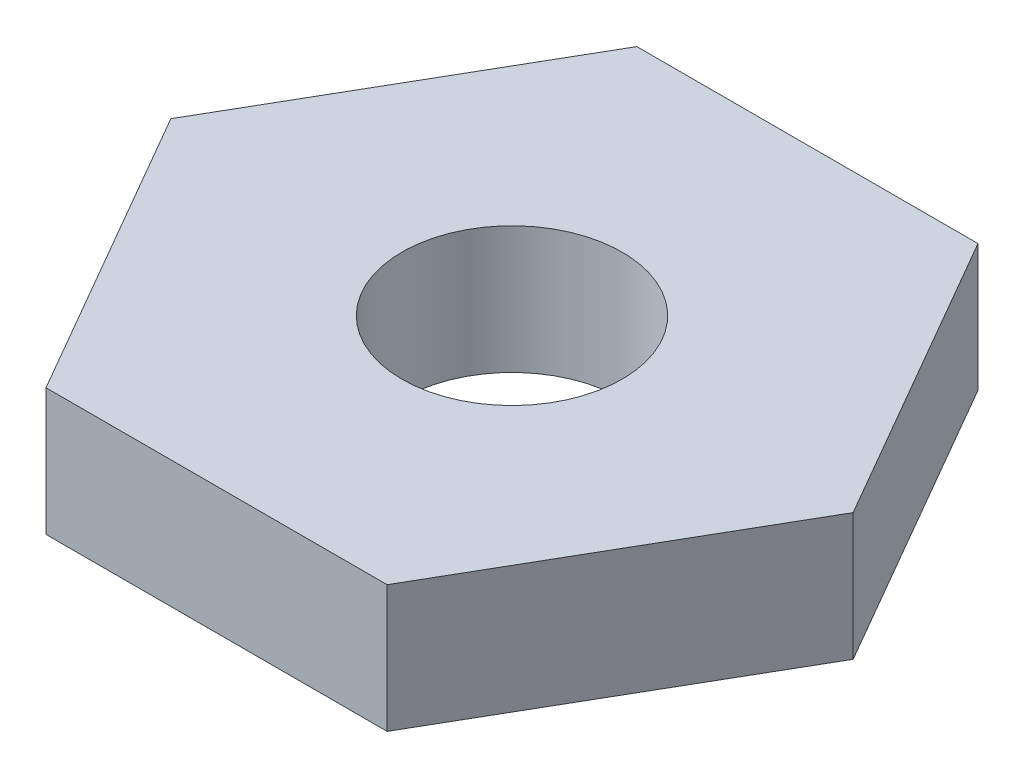
ISO-10303-21;
HEADER;
FILE_DESCRIPTION(('STEP AP214'),'2;1');
FILE_NAME('part.step','',(''),(''),'','','');
FILE_SCHEMA(('AUTOMOTIVE_DESIGN { 1 0 10303 214 1 1 1 1 }'));
ENDSEC;
DATA;
#1=APPLICATION_CONTEXT('core data for automotive mechanical design processes');
#2=APPLICATION_PROTOCOL_DEFINITION('international standard','automotive_design',2000,#1);
#3=PRODUCT_CONTEXT('',#1,'mechanical');
#4=PRODUCT('Part','Part','',(#3));
#5=PRODUCT_RELATED_PRODUCT_CATEGORY('part','',(#4));
#6=PRODUCT_DEFINITION_FORMATION('','',#4);
#7=PRODUCT_DEFINITION_CONTEXT('part definition',#1,'design');
#8=PRODUCT_DEFINITION('design','',#6,#7);
#9=PRODUCT_DEFINITION_SHAPE('','',#8);
#10=(LENGTH_UNIT() NAMED_UNIT(*) SI_UNIT(.MILLI.,.METRE.));
#11=(NAMED_UNIT(*) PLANE_ANGLE_UNIT() SI_UNIT($,.RADIAN.));
#12=(NAMED_UNIT(*) SI_UNIT($,.STERADIAN.) SOLID_ANGLE_UNIT());
#13=UNCERTAINTY_MEASURE_WITH_UNIT(LENGTH_MEASURE(1.E-05),#10,'distance_accuracy_value','');
#14=(GEOMETRIC_REPRESENTATION_CONTEXT(3) GLOBAL_UNCERTAINTY_ASSIGNED_CONTEXT((#13)) GLOBAL_UNIT_ASSIGNED_CONTEXT((#10,
#11,#12)) REPRESENTATION_CONTEXT('',''));
#15=CARTESIAN_POINT('',(0.,0.,0.));
#16=DIRECTION('',(0.,0.,1.));
#17=DIRECTION('',(1.,0.,0.));
#18=AXIS2_PLACEMENT_3D('',#15,#16,#17);
#19=CARTESIAN_POINT('',(0.,3.81,0.));
#20=DIRECTION('',(0.,1.,0.));
#21=DIRECTION('',(0.,0.,1.));
#22=AXIS2_PLACEMENT_3D('',#19,#20,#21);
#23=PLANE('',#22);
#24=DIRECTION('',(0.499999999999995,0.,-0.866025403784442));
#25=VECTOR('',#24,1.);
#26=CARTESIAN_POINT('',(5.11475778970243,3.81,8.85902036017307));
#27=LINE('',#26,#25);
#28=CARTESIAN_POINT('',(5.11475778970243,3.81,8.85902036017307));
#29=VERTEX_POINT('',#28);
#30=CARTESIAN_POINT('',(10.2295155794047,3.81,0.));
#31=VERTEX_POINT('',#30);
#32=EDGE_CURVE('E150',#29,#31,#27,.T.);
#33=ORIENTED_EDGE('',*,*,#32,.T.);
#34=DIRECTION('',(-0.500000000000001,0.,-0.866025403784438));
#35=VECTOR('',#34,1.);
#36=CARTESIAN_POINT('',(10.2295155794047,3.81,0.));
#37=LINE('',#36,#35);
#38=CARTESIAN_POINT('',(5.11475778970231,3.81,-8.85902036017314));
#39=VERTEX_POINT('',#38);
#40=EDGE_CURVE('E98',#31,#39,#37,.T.);
#41=ORIENTED_EDGE('',*,*,#40,.T.);
#42=DIRECTION('',(-1.,0.,0.));
#43=VECTOR('',#42,1.);
#44=CARTESIAN_POINT('',(5.11475778970231,3.81,-8.85902036017314));
#45=LINE('',#44,#43);
#46=CARTESIAN_POINT('',(-5.11475778970237,3.81,-8.85902036017311));
#47=VERTEX_POINT('',#46);
#48=EDGE_CURVE('E111',#39,#47,#45,.T.);
#49=ORIENTED_EDGE('',*,*,#48,.T.);
#50=DIRECTION('',(-0.499999999999995,0.,0.866025403784441));
#51=VECTOR('',#50,1.);
#52=CARTESIAN_POINT('',(-5.11475778970237,3.81,-8.85902036017311));
#53=LINE('',#52,#51);
#54=CARTESIAN_POINT('',(-10.2295155794047,3.81,0.));
#55=VERTEX_POINT('',#54);
#56=EDGE_CURVE('E105',#47,#55,#53,.T.);
#57=ORIENTED_EDGE('',*,*,#56,.T.);
#58=DIRECTION('',(0.500000000000007,0.,0.866025403784434));
#59=VECTOR('',#58,1.);
#60=CARTESIAN_POINT('',(-10.2295155794047,3.81,0.));
#61=LINE('',#60,#59);
#62=CARTESIAN_POINT('',(-5.11475778970225,3.81,8.85902036017318));
#63=VERTEX_POINT('',#62);
#64=EDGE_CURVE('E109',#55,#63,#61,.T.);
#65=ORIENTED_EDGE('',*,*,#64,.T.);
#66=DIRECTION('',(1.,0.,0.));
#67=VECTOR('',#66,1.);
#68=CARTESIAN_POINT('',(-5.11475778970225,3.81,8.85902036017318));
#69=LINE('',#68,#67);
#70=EDGE_CURVE('E61',#63,#29,#69,.T.);
#71=ORIENTED_EDGE('',*,*,#70,.T.);
#72=EDGE_LOOP('',(#33,#41,#49,#57,#65,#71));
#73=FACE_BOUND('',#72,.T.);
#74=CARTESIAN_POINT('',(0.,3.81,0.));
#75=DIRECTION('',(0.,1.,0.));
#76=DIRECTION('',(0.,0.,1.));
#77=AXIS2_PLACEMENT_3D('',#74,#75,#76);
#78=CIRCLE('',#77,3.302);
#79=CARTESIAN_POINT('',(0.,3.81,3.302));
#80=VERTEX_POINT('',#79);
#81=EDGE_CURVE('E138',#80,#80,#78,.T.);
#82=ORIENTED_EDGE('',*,*,#81,.F.);
#83=EDGE_LOOP('',(#82));
#84=FACE_BOUND('',#83,.T.);
#85=ADVANCED_FACE('F43',(#73,#84),#23,.T.);
#86=CARTESIAN_POINT('',(0.,0.,0.));
#87=DIRECTION('',(0.,1.,0.));
#88=DIRECTION('',(0.,0.,1.));
#89=AXIS2_PLACEMENT_3D('',#86,#87,#88);
#90=PLANE('',#89);
#91=DIRECTION('',(0.499999999999995,0.,-0.866025403784442));
#92=VECTOR('',#91,1.);
#93=CARTESIAN_POINT('',(5.11475778970243,0.,8.85902036017307));
#94=LINE('',#93,#92);
#95=CARTESIAN_POINT('',(5.11475778970243,0.,8.85902036017307));
#96=VERTEX_POINT('',#95);
#97=CARTESIAN_POINT('',(10.2295155794047,0.,0.));
#98=VERTEX_POINT('',#97);
#99=EDGE_CURVE('E133',#96,#98,#94,.T.);
#100=ORIENTED_EDGE('',*,*,#99,.F.);
#101=DIRECTION('',(1.,0.,0.));
#102=VECTOR('',#101,1.);
#103=CARTESIAN_POINT('',(-5.11475778970225,0.,8.85902036017318));
#104=LINE('',#103,#102);
#105=CARTESIAN_POINT('',(-5.11475778970225,0.,8.85902036017318));
#106=VERTEX_POINT('',#105);
#107=EDGE_CURVE('E90',#106,#96,#104,.T.);
#108=ORIENTED_EDGE('',*,*,#107,.F.);
#109=DIRECTION('',(0.500000000000007,0.,0.866025403784434));
#110=VECTOR('',#109,1.);
#111=CARTESIAN_POINT('',(-10.2295155794047,0.,0.));
#112=LINE('',#111,#110);
#113=CARTESIAN_POINT('',(-10.2295155794047,0.,0.));
#114=VERTEX_POINT('',#113);
#115=EDGE_CURVE('E84',#114,#106,#112,.T.);
#116=ORIENTED_EDGE('',*,*,#115,.F.);
#117=DIRECTION('',(-0.499999999999995,0.,0.866025403784441));
#118=VECTOR('',#117,1.);
#119=CARTESIAN_POINT('',(-5.11475778970237,0.,-8.85902036017311));
#120=LINE('',#119,#118);
#121=CARTESIAN_POINT('',(-5.11475778970237,0.,-8.85902036017311));
#122=VERTEX_POINT('',#121);
#123=EDGE_CURVE('E120',#122,#114,#120,.T.);
#124=ORIENTED_EDGE('',*,*,#123,.F.);
#125=DIRECTION('',(-1.,0.,0.));
#126=VECTOR('',#125,1.);
#127=CARTESIAN_POINT('',(5.11475778970231,0.,-8.85902036017314));
#128=LINE('',#127,#126);
#129=CARTESIAN_POINT('',(5.11475778970231,0.,-8.85902036017314));
#130=VERTEX_POINT('',#129);
#131=EDGE_CURVE('E141',#130,#122,#128,.T.);
#132=ORIENTED_EDGE('',*,*,#131,.F.);
#133=DIRECTION('',(-0.500000000000001,0.,-0.866025403784438));
#134=VECTOR('',#133,1.);
#135=CARTESIAN_POINT('',(10.2295155794047,0.,0.));
#136=LINE('',#135,#134);
#137=EDGE_CURVE('E137',#98,#130,#136,.T.);
#138=ORIENTED_EDGE('',*,*,#137,.F.);
#139=EDGE_LOOP('',(#100,#108,#116,#124,#132,#138));
#140=FACE_BOUND('',#139,.T.);
#141=CARTESIAN_POINT('',(0.,0.,0.));
#142=DIRECTION('',(0.,1.,0.));
#143=DIRECTION('',(0.,0.,1.));
#144=AXIS2_PLACEMENT_3D('',#141,#142,#143);
#145=CIRCLE('',#144,3.302);
#146=CARTESIAN_POINT('',(0.,0.,3.302));
#147=VERTEX_POINT('',#146);
#148=EDGE_CURVE('E265',#147,#147,#145,.T.);
#149=ORIENTED_EDGE('',*,*,#148,.T.);
#150=EDGE_LOOP('',(#149));
#151=FACE_BOUND('',#150,.T.);
#152=ADVANCED_FACE('F163',(#140,#151),#90,.F.);
#153=CARTESIAN_POINT('',(5.11475778970243,3.81,8.85902036017307));
#154=DIRECTION('',(-0.866025403784441,0.,-0.499999999999995));
#155=DIRECTION('',(-0.499999999999995,0.,0.866025403784442));
#156=AXIS2_PLACEMENT_3D('',#153,#154,#155);
#157=PLANE('',#156);
#158=ORIENTED_EDGE('',*,*,#99,.T.);
#159=DIRECTION('',(0.,-1.,0.));
#160=VECTOR('',#159,1.);
#161=CARTESIAN_POINT('',(10.2295155794047,3.81,0.));
#162=LINE('',#161,#160);
#163=EDGE_CURVE('E11',#31,#98,#162,.T.);
#164=ORIENTED_EDGE('',*,*,#163,.F.);
#165=ORIENTED_EDGE('',*,*,#32,.F.);
#166=DIRECTION('',(0.,-1.,0.));
#167=VECTOR('',#166,1.);
#168=CARTESIAN_POINT('',(5.11475778970243,3.81,8.85902036017307));
#169=LINE('',#168,#167);
#170=EDGE_CURVE('E129',#29,#96,#169,.T.);
#171=ORIENTED_EDGE('',*,*,#170,.T.);
#172=EDGE_LOOP('',(#158,#164,#165,#171));
#173=FACE_BOUND('',#172,.T.);
#174=ADVANCED_FACE('F45',(#173),#157,.F.);
#175=CARTESIAN_POINT('',(10.2295155794047,3.81,0.));
#176=DIRECTION('',(-0.866025403784438,0.,0.500000000000001));
#177=DIRECTION('',(0.500000000000001,0.,0.866025403784438));
#178=AXIS2_PLACEMENT_3D('',#175,#176,#177);
#179=PLANE('',#178);
#180=ORIENTED_EDGE('',*,*,#137,.T.);
#181=DIRECTION('',(0.,-1.,0.));
#182=VECTOR('',#181,1.);
#183=CARTESIAN_POINT('',(5.11475778970231,3.81,-8.85902036017314));
#184=LINE('',#183,#182);
#185=EDGE_CURVE('E53',#39,#130,#184,.T.);
#186=ORIENTED_EDGE('',*,*,#185,.F.);
#187=ORIENTED_EDGE('',*,*,#40,.F.);
#188=ORIENTED_EDGE('',*,*,#163,.T.);
#189=EDGE_LOOP('',(#180,#186,#187,#188));
#190=FACE_BOUND('',#189,.T.);
#191=ADVANCED_FACE('F188',(#190),#179,.F.);
#192=CARTESIAN_POINT('',(5.11475778970231,3.81,-8.85902036017314));
#193=DIRECTION('',(0.,0.,1.));
#194=DIRECTION('',(1.,0.,0.));
#195=AXIS2_PLACEMENT_3D('',#192,#193,#194);
#196=PLANE('',#195);
#197=ORIENTED_EDGE('',*,*,#131,.T.);
#198=DIRECTION('',(0.,-1.,0.));
#199=VECTOR('',#198,1.);
#200=CARTESIAN_POINT('',(-5.11475778970237,3.81,-8.85902036017311));
#201=LINE('',#200,#199);
#202=EDGE_CURVE('E122',#47,#122,#201,.T.);
#203=ORIENTED_EDGE('',*,*,#202,.F.);
#204=ORIENTED_EDGE('',*,*,#48,.F.);
#205=ORIENTED_EDGE('',*,*,#185,.T.);
#206=EDGE_LOOP('',(#197,#203,#204,#205));
#207=FACE_BOUND('',#206,.T.);
#208=ADVANCED_FACE('F160',(#207),#196,.F.);
#209=CARTESIAN_POINT('',(-5.11475778970237,3.81,-8.85902036017311));
#210=DIRECTION('',(0.866025403784442,0.,0.499999999999995));
#211=DIRECTION('',(0.499999999999995,0.,-0.866025403784442));
#212=AXIS2_PLACEMENT_3D('',#209,#210,#211);
#213=PLANE('',#212);
#214=ORIENTED_EDGE('',*,*,#123,.T.);
#215=DIRECTION('',(0.,-1.,0.));
#216=VECTOR('',#215,1.);
#217=CARTESIAN_POINT('',(-10.2295155794047,3.81,0.));
#218=LINE('',#217,#216);
#219=EDGE_CURVE('E117',#55,#114,#218,.T.);
#220=ORIENTED_EDGE('',*,*,#219,.F.);
#221=ORIENTED_EDGE('',*,*,#56,.F.);
#222=ORIENTED_EDGE('',*,*,#202,.T.);
#223=EDGE_LOOP('',(#214,#220,#221,#222));
#224=FACE_BOUND('',#223,.T.);
#225=ADVANCED_FACE('F118',(#224),#213,.F.);
#226=CARTESIAN_POINT('',(-10.2295155794047,3.81,0.));
#227=DIRECTION('',(0.866025403784435,0.,-0.500000000000007));
#228=DIRECTION('',(-0.500000000000007,0.,-0.866025403784435));
#229=AXIS2_PLACEMENT_3D('',#226,#227,#228);
#230=PLANE('',#229);
#231=ORIENTED_EDGE('',*,*,#115,.T.);
#232=DIRECTION('',(0.,-1.,0.));
#233=VECTOR('',#232,1.);
#234=CARTESIAN_POINT('',(-5.11475778970225,3.81,8.85902036017318));
#235=LINE('',#234,#233);
#236=EDGE_CURVE('E123',#63,#106,#235,.T.);
#237=ORIENTED_EDGE('',*,*,#236,.F.);
#238=ORIENTED_EDGE('',*,*,#64,.F.);
#239=ORIENTED_EDGE('',*,*,#219,.T.);
#240=EDGE_LOOP('',(#231,#237,#238,#239));
#241=FACE_BOUND('',#240,.T.);
#242=ADVANCED_FACE('F125',(#241),#230,.F.);
#243=CARTESIAN_POINT('',(-5.11475778970225,3.81,8.85902036017318));
#244=DIRECTION('',(0.,0.,-1.));
#245=DIRECTION('',(-1.,0.,0.));
#246=AXIS2_PLACEMENT_3D('',#243,#244,#245);
#247=PLANE('',#246);
#248=ORIENTED_EDGE('',*,*,#107,.T.);
#249=ORIENTED_EDGE('',*,*,#170,.F.);
#250=ORIENTED_EDGE('',*,*,#70,.F.);
#251=ORIENTED_EDGE('',*,*,#236,.T.);
#252=EDGE_LOOP('',(#248,#249,#250,#251));
#253=FACE_BOUND('',#252,.T.);
#254=ADVANCED_FACE('F168',(#253),#247,.F.);
#255=CARTESIAN_POINT('',(0.,3.81,0.));
#256=DIRECTION('',(0.,-1.,0.));
#257=DIRECTION('',(0.,0.,-1.));
#258=AXIS2_PLACEMENT_3D('',#255,#256,#257);
#259=CYLINDRICAL_SURFACE('',#258,3.302);
#260=ORIENTED_EDGE('',*,*,#81,.T.);
#261=EDGE_LOOP('',(#260));
#262=FACE_BOUND('',#261,.T.);
#263=ORIENTED_EDGE('',*,*,#148,.F.);
#264=EDGE_LOOP('',(#263));
#265=FACE_BOUND('',#264,.T.);
#266=ADVANCED_FACE('F170',(#262,#265),#259,.F.);
#267=CLOSED_SHELL('',(#85,#152,#174,#191,#208,#225,#242,#254,#266));
#268=MANIFOLD_SOLID_BREP('B2',#267);
#269=ADVANCED_BREP_SHAPE_REPRESENTATION('',(#18,#268),#14);
#270=SHAPE_DEFINITION_REPRESENTATION(#9,#269);
ENDSEC;
END-ISO-10303-21;
